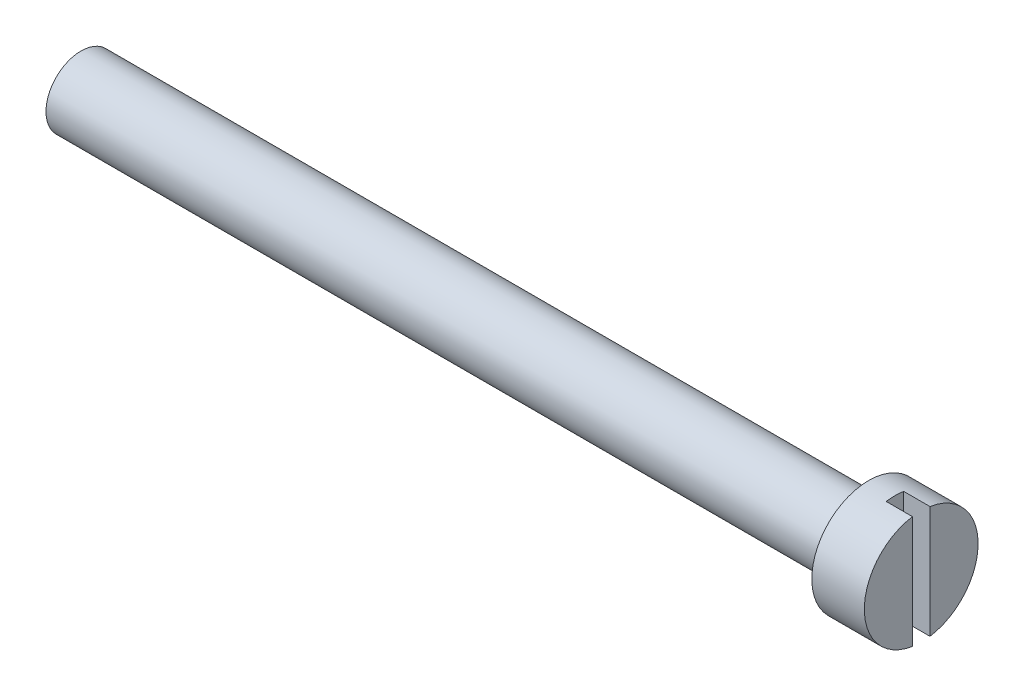
ISO-10303-21;
HEADER;
FILE_DESCRIPTION(('STEP AP214'),'2;1');
FILE_NAME('part.step','',(''),(''),'','','');
FILE_SCHEMA(('AUTOMOTIVE_DESIGN { 1 0 10303 214 1 1 1 1 }'));
ENDSEC;
DATA;
#1=APPLICATION_CONTEXT('core data for automotive mechanical design processes');
#2=APPLICATION_PROTOCOL_DEFINITION('international standard','automotive_design',2000,#1);
#3=PRODUCT_CONTEXT('',#1,'mechanical');
#4=PRODUCT('Part','Part','',(#3));
#5=PRODUCT_RELATED_PRODUCT_CATEGORY('part','',(#4));
#6=PRODUCT_DEFINITION_FORMATION('','',#4);
#7=PRODUCT_DEFINITION_CONTEXT('part definition',#1,'design');
#8=PRODUCT_DEFINITION('design','',#6,#7);
#9=PRODUCT_DEFINITION_SHAPE('','',#8);
#10=(LENGTH_UNIT() NAMED_UNIT(*) SI_UNIT(.MILLI.,.METRE.));
#11=(NAMED_UNIT(*) PLANE_ANGLE_UNIT() SI_UNIT($,.RADIAN.));
#12=(NAMED_UNIT(*) SI_UNIT($,.STERADIAN.) SOLID_ANGLE_UNIT());
#13=UNCERTAINTY_MEASURE_WITH_UNIT(LENGTH_MEASURE(1.E-05),#10,'distance_accuracy_value','');
#14=(GEOMETRIC_REPRESENTATION_CONTEXT(3) GLOBAL_UNCERTAINTY_ASSIGNED_CONTEXT((#13)) GLOBAL_UNIT_ASSIGNED_CONTEXT((#10,
#11,#12)) REPRESENTATION_CONTEXT('',''));
#15=CARTESIAN_POINT('',(0.,0.,0.));
#16=DIRECTION('',(0.,0.,1.));
#17=DIRECTION('',(1.,0.,0.));
#18=AXIS2_PLACEMENT_3D('',#15,#16,#17);
#19=CARTESIAN_POINT('',(0.,3.25,0.));
#20=DIRECTION('',(1.,0.,0.));
#21=DIRECTION('',(0.,1.,0.));
#22=AXIS2_PLACEMENT_3D('',#19,#20,#21);
#23=PLANE('',#22);
#24=DIRECTION('',(0.,1.,0.));
#25=VECTOR('',#24,1.);
#26=CARTESIAN_POINT('',(0.,-3.25,-0.5));
#27=LINE('',#26,#25);
#28=CARTESIAN_POINT('',(0.,-3.21130814466628,-0.5));
#29=VERTEX_POINT('',#28);
#30=CARTESIAN_POINT('',(0.,3.21130814466628,-0.5));
#31=VERTEX_POINT('',#30);
#32=EDGE_CURVE('E88',#29,#31,#27,.T.);
#33=ORIENTED_EDGE('',*,*,#32,.F.);
#34=CARTESIAN_POINT('',(0.,0.,0.));
#35=DIRECTION('',(1.,0.,0.));
#36=DIRECTION('',(0.,1.,0.));
#37=AXIS2_PLACEMENT_3D('',#34,#35,#36);
#38=CIRCLE('',#37,3.25);
#39=EDGE_CURVE('E99',#29,#31,#38,.T.);
#40=ORIENTED_EDGE('',*,*,#39,.T.);
#41=EDGE_LOOP('',(#33,#40));
#42=FACE_BOUND('',#41,.T.);
#43=ADVANCED_FACE('F45',(#42),#23,.T.);
#44=DIRECTION('',(0.,-1.,0.));
#45=VECTOR('',#44,1.);
#46=CARTESIAN_POINT('',(0.,-3.25,0.5));
#47=LINE('',#46,#45);
#48=CARTESIAN_POINT('',(0.,3.21130814466628,0.5));
#49=VERTEX_POINT('',#48);
#50=CARTESIAN_POINT('',(0.,-3.21130814466628,0.5));
#51=VERTEX_POINT('',#50);
#52=EDGE_CURVE('E101',#49,#51,#47,.T.);
#53=ORIENTED_EDGE('',*,*,#52,.F.);
#54=EDGE_CURVE('E106',#49,#51,#38,.T.);
#55=ORIENTED_EDGE('',*,*,#54,.T.);
#56=EDGE_LOOP('',(#53,#55));
#57=FACE_BOUND('',#56,.T.);
#58=ADVANCED_FACE('F47',(#57),#23,.T.);
#59=CARTESIAN_POINT('',(-48.,0.,0.));
#60=DIRECTION('',(-1.,0.,0.));
#61=DIRECTION('',(0.,-1.,0.));
#62=AXIS2_PLACEMENT_3D('',#59,#60,#61);
#63=PLANE('',#62);
#64=CARTESIAN_POINT('',(-48.,0.,0.));
#65=DIRECTION('',(1.,0.,0.));
#66=DIRECTION('',(0.,1.,0.));
#67=AXIS2_PLACEMENT_3D('',#64,#65,#66);
#68=CIRCLE('',#67,2.);
#69=CARTESIAN_POINT('',(-48.,2.,0.));
#70=VERTEX_POINT('',#69);
#71=EDGE_CURVE('E122',#70,#70,#68,.T.);
#72=ORIENTED_EDGE('',*,*,#71,.F.);
#73=EDGE_LOOP('',(#72));
#74=FACE_BOUND('',#73,.T.);
#75=ADVANCED_FACE('F154',(#74),#63,.T.);
#76=CARTESIAN_POINT('',(0.,0.,0.));
#77=DIRECTION('',(1.,0.,0.));
#78=DIRECTION('',(0.,1.,0.));
#79=AXIS2_PLACEMENT_3D('',#76,#77,#78);
#80=CYLINDRICAL_SURFACE('',#79,2.);
#81=ORIENTED_EDGE('',*,*,#71,.T.);
#82=EDGE_LOOP('',(#81));
#83=FACE_BOUND('',#82,.T.);
#84=CARTESIAN_POINT('',(-3.,0.,0.));
#85=DIRECTION('',(1.,0.,0.));
#86=DIRECTION('',(0.,1.,0.));
#87=AXIS2_PLACEMENT_3D('',#84,#85,#86);
#88=CIRCLE('',#87,2.);
#89=CARTESIAN_POINT('',(-3.,2.,0.));
#90=VERTEX_POINT('',#89);
#91=EDGE_CURVE('E118',#90,#90,#88,.T.);
#92=ORIENTED_EDGE('',*,*,#91,.F.);
#93=EDGE_LOOP('',(#92));
#94=FACE_BOUND('',#93,.T.);
#95=ADVANCED_FACE('F159',(#83,#94),#80,.T.);
#96=CARTESIAN_POINT('',(-3.,2.,0.));
#97=DIRECTION('',(-1.,0.,0.));
#98=DIRECTION('',(0.,-1.,0.));
#99=AXIS2_PLACEMENT_3D('',#96,#97,#98);
#100=PLANE('',#99);
#101=ORIENTED_EDGE('',*,*,#91,.T.);
#102=EDGE_LOOP('',(#101));
#103=FACE_BOUND('',#102,.T.);
#104=CARTESIAN_POINT('',(-3.,0.,0.));
#105=DIRECTION('',(1.,0.,0.));
#106=DIRECTION('',(0.,1.,0.));
#107=AXIS2_PLACEMENT_3D('',#104,#105,#106);
#108=CIRCLE('',#107,3.25);
#109=CARTESIAN_POINT('',(-3.,3.25,0.));
#110=VERTEX_POINT('',#109);
#111=EDGE_CURVE('E111',#110,#110,#108,.T.);
#112=ORIENTED_EDGE('',*,*,#111,.F.);
#113=EDGE_LOOP('',(#112));
#114=FACE_BOUND('',#113,.T.);
#115=ADVANCED_FACE('F164',(#103,#114),#100,.T.);
#116=CARTESIAN_POINT('',(0.,0.,0.));
#117=DIRECTION('',(1.,0.,0.));
#118=DIRECTION('',(0.,1.,0.));
#119=AXIS2_PLACEMENT_3D('',#116,#117,#118);
#120=CYLINDRICAL_SURFACE('',#119,3.25);
#121=DIRECTION('',(1.,0.,0.));
#122=VECTOR('',#121,1.);
#123=CARTESIAN_POINT('',(0.,3.21130814466628,-0.5));
#124=LINE('',#123,#122);
#125=CARTESIAN_POINT('',(-1.5,3.21130814466628,-0.5));
#126=VERTEX_POINT('',#125);
#127=EDGE_CURVE('E11',#31,#126,#124,.F.);
#128=ORIENTED_EDGE('',*,*,#127,.F.);
#129=ORIENTED_EDGE('',*,*,#39,.F.);
#130=DIRECTION('',(1.,0.,0.));
#131=VECTOR('',#130,1.);
#132=CARTESIAN_POINT('',(0.,-3.21130814466628,-0.5));
#133=LINE('',#132,#131);
#134=CARTESIAN_POINT('',(-1.5,-3.21130814466628,-0.5));
#135=VERTEX_POINT('',#134);
#136=EDGE_CURVE('E85',#135,#29,#133,.T.);
#137=ORIENTED_EDGE('',*,*,#136,.F.);
#138=CARTESIAN_POINT('',(-1.5,0.,0.));
#139=DIRECTION('',(-1.,0.,0.));
#140=DIRECTION('',(0.,-1.,0.));
#141=AXIS2_PLACEMENT_3D('',#138,#139,#140);
#142=CIRCLE('',#141,3.25);
#143=CARTESIAN_POINT('',(-1.5,-3.21130814466628,0.5));
#144=VERTEX_POINT('',#143);
#145=EDGE_CURVE('E126',#144,#135,#142,.F.);
#146=ORIENTED_EDGE('',*,*,#145,.F.);
#147=DIRECTION('',(1.,0.,0.));
#148=VECTOR('',#147,1.);
#149=CARTESIAN_POINT('',(0.,-3.21130814466628,0.5));
#150=LINE('',#149,#148);
#151=EDGE_CURVE('E95',#51,#144,#150,.F.);
#152=ORIENTED_EDGE('',*,*,#151,.F.);
#153=ORIENTED_EDGE('',*,*,#54,.F.);
#154=DIRECTION('',(1.,0.,0.));
#155=VECTOR('',#154,1.);
#156=CARTESIAN_POINT('',(0.,3.21130814466628,0.5));
#157=LINE('',#156,#155);
#158=CARTESIAN_POINT('',(-1.5,3.21130814466628,0.5));
#159=VERTEX_POINT('',#158);
#160=EDGE_CURVE('E54',#159,#49,#157,.T.);
#161=ORIENTED_EDGE('',*,*,#160,.F.);
#162=EDGE_CURVE('E66',#126,#159,#142,.F.);
#163=ORIENTED_EDGE('',*,*,#162,.F.);
#164=EDGE_LOOP('',(#128,#129,#137,#146,#152,#153,#161,#163));
#165=FACE_BOUND('',#164,.T.);
#166=ORIENTED_EDGE('',*,*,#111,.T.);
#167=EDGE_LOOP('',(#166));
#168=FACE_BOUND('',#167,.T.);
#169=ADVANCED_FACE('F103',(#165,#168),#120,.T.);
#170=CARTESIAN_POINT('',(-1.5,-3.25,-0.5));
#171=DIRECTION('',(0.,0.,-1.));
#172=DIRECTION('',(-1.,0.,0.));
#173=AXIS2_PLACEMENT_3D('',#170,#171,#172);
#174=PLANE('',#173);
#175=ORIENTED_EDGE('',*,*,#127,.T.);
#176=DIRECTION('',(0.,1.,0.));
#177=VECTOR('',#176,1.);
#178=CARTESIAN_POINT('',(-1.5,-3.25,-0.5));
#179=LINE('',#178,#177);
#180=EDGE_CURVE('E90',#135,#126,#179,.T.);
#181=ORIENTED_EDGE('',*,*,#180,.F.);
#182=ORIENTED_EDGE('',*,*,#136,.T.);
#183=ORIENTED_EDGE('',*,*,#32,.T.);
#184=EDGE_LOOP('',(#175,#181,#182,#183));
#185=FACE_BOUND('',#184,.T.);
#186=ADVANCED_FACE('F87',(#185),#174,.F.);
#187=CARTESIAN_POINT('',(-1.5,-3.25,0.5));
#188=DIRECTION('',(0.,0.,1.));
#189=DIRECTION('',(1.,0.,0.));
#190=AXIS2_PLACEMENT_3D('',#187,#188,#189);
#191=PLANE('',#190);
#192=ORIENTED_EDGE('',*,*,#151,.T.);
#193=DIRECTION('',(0.,-1.,0.));
#194=VECTOR('',#193,1.);
#195=CARTESIAN_POINT('',(-1.5,-3.25,0.5));
#196=LINE('',#195,#194);
#197=EDGE_CURVE('E61',#159,#144,#196,.T.);
#198=ORIENTED_EDGE('',*,*,#197,.F.);
#199=ORIENTED_EDGE('',*,*,#160,.T.);
#200=ORIENTED_EDGE('',*,*,#52,.T.);
#201=EDGE_LOOP('',(#192,#198,#199,#200));
#202=FACE_BOUND('',#201,.T.);
#203=ADVANCED_FACE('F135',(#202),#191,.F.);
#204=CARTESIAN_POINT('',(-1.5,0.,0.));
#205=DIRECTION('',(-1.,0.,0.));
#206=DIRECTION('',(0.,-1.,0.));
#207=AXIS2_PLACEMENT_3D('',#204,#205,#206);
#208=PLANE('',#207);
#209=ORIENTED_EDGE('',*,*,#180,.T.);
#210=ORIENTED_EDGE('',*,*,#162,.T.);
#211=ORIENTED_EDGE('',*,*,#197,.T.);
#212=ORIENTED_EDGE('',*,*,#145,.T.);
#213=EDGE_LOOP('',(#209,#210,#211,#212));
#214=FACE_BOUND('',#213,.T.);
#215=ADVANCED_FACE('F140',(#214),#208,.F.);
#216=CLOSED_SHELL('',(#43,#58,#75,#95,#115,#169,#186,#203,#215));
#217=MANIFOLD_SOLID_BREP('B2',#216);
#218=ADVANCED_BREP_SHAPE_REPRESENTATION('',(#18,#217),#14);
#219=SHAPE_DEFINITION_REPRESENTATION(#9,#218);
ENDSEC;
END-ISO-10303-21;
